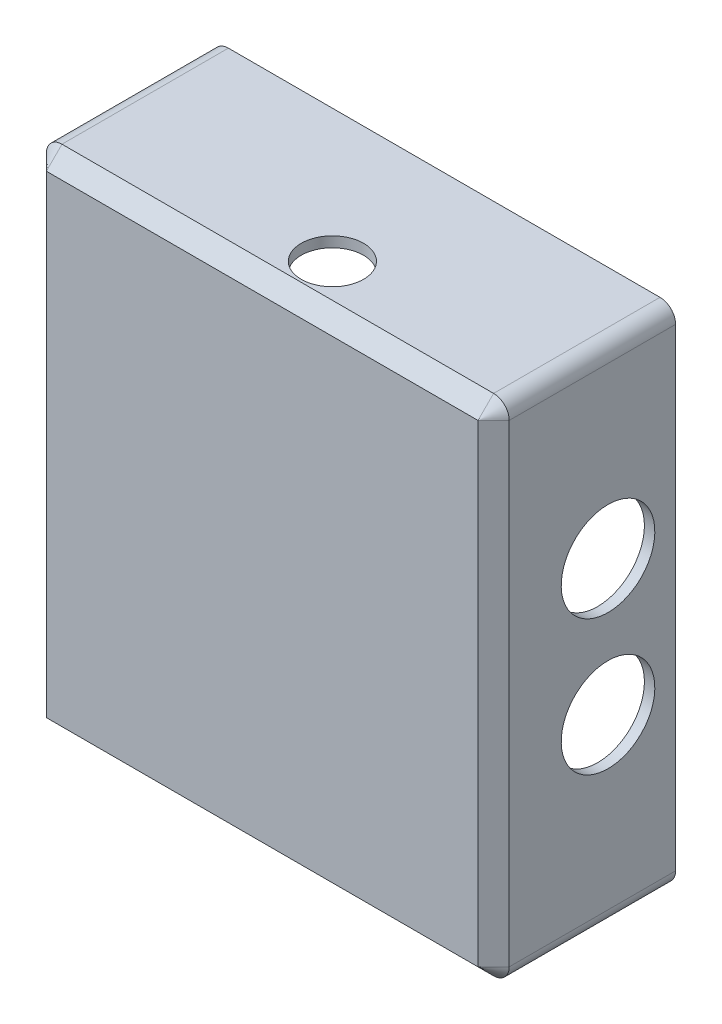
ISO-10303-21;
HEADER;
FILE_DESCRIPTION(('STEP AP214'),'2;1');
FILE_NAME('part.step','',(''),(''),'','','');
FILE_SCHEMA(('AUTOMOTIVE_DESIGN { 1 0 10303 214 1 1 1 1 }'));
ENDSEC;
DATA;
#1=APPLICATION_CONTEXT('core data for automotive mechanical design processes');
#2=APPLICATION_PROTOCOL_DEFINITION('international standard','automotive_design',2000,#1);
#3=PRODUCT_CONTEXT('',#1,'mechanical');
#4=PRODUCT('Part','Part','',(#3));
#5=PRODUCT_RELATED_PRODUCT_CATEGORY('part','',(#4));
#6=PRODUCT_DEFINITION_FORMATION('','',#4);
#7=PRODUCT_DEFINITION_CONTEXT('part definition',#1,'design');
#8=PRODUCT_DEFINITION('design','',#6,#7);
#9=PRODUCT_DEFINITION_SHAPE('','',#8);
#10=(LENGTH_UNIT() NAMED_UNIT(*) SI_UNIT(.MILLI.,.METRE.));
#11=(NAMED_UNIT(*) PLANE_ANGLE_UNIT() SI_UNIT($,.RADIAN.));
#12=(NAMED_UNIT(*) SI_UNIT($,.STERADIAN.) SOLID_ANGLE_UNIT());
#13=UNCERTAINTY_MEASURE_WITH_UNIT(LENGTH_MEASURE(1.E-05),#10,'distance_accuracy_value','');
#14=(GEOMETRIC_REPRESENTATION_CONTEXT(3) GLOBAL_UNCERTAINTY_ASSIGNED_CONTEXT((#13)) GLOBAL_UNIT_ASSIGNED_CONTEXT((#10,
#11,#12)) REPRESENTATION_CONTEXT('',''));
#15=CARTESIAN_POINT('',(0.,0.,0.));
#16=DIRECTION('',(0.,0.,1.));
#17=DIRECTION('',(1.,0.,0.));
#18=AXIS2_PLACEMENT_3D('',#15,#16,#17);
#19=CARTESIAN_POINT('',(0.,0.,0.));
#20=DIRECTION('',(0.,0.,1.));
#21=DIRECTION('',(1.,0.,0.));
#22=AXIS2_PLACEMENT_3D('',#19,#20,#21);
#23=PLANE('',#22);
#24=DIRECTION('',(-1.,0.,0.));
#25=VECTOR('',#24,1.);
#26=CARTESIAN_POINT('',(-44.5,48.5,0.));
#27=LINE('',#26,#25);
#28=CARTESIAN_POINT('',(41.5,48.5,0.));
#29=VERTEX_POINT('',#28);
#30=CARTESIAN_POINT('',(-41.5,48.5,0.));
#31=VERTEX_POINT('',#30);
#32=EDGE_CURVE('E306',#29,#31,#27,.T.);
#33=ORIENTED_EDGE('',*,*,#32,.F.);
#34=CARTESIAN_POINT('',(41.5,45.5,0.));
#35=DIRECTION('',(0.,0.,1.));
#36=DIRECTION('',(1.,0.,0.));
#37=AXIS2_PLACEMENT_3D('',#34,#35,#36);
#38=CIRCLE('',#37,3.);
#39=CARTESIAN_POINT('',(44.5,45.5,0.));
#40=VERTEX_POINT('',#39);
#41=EDGE_CURVE('E327',#29,#40,#38,.F.);
#42=ORIENTED_EDGE('',*,*,#41,.T.);
#43=DIRECTION('',(0.,1.,0.));
#44=VECTOR('',#43,1.);
#45=CARTESIAN_POINT('',(44.5,48.5,0.));
#46=LINE('',#45,#44);
#47=CARTESIAN_POINT('',(44.5,-45.5,0.));
#48=VERTEX_POINT('',#47);
#49=EDGE_CURVE('E303',#48,#40,#46,.T.);
#50=ORIENTED_EDGE('',*,*,#49,.F.);
#51=CARTESIAN_POINT('',(41.5,-45.5,0.));
#52=DIRECTION('',(0.,0.,1.));
#53=DIRECTION('',(1.,0.,0.));
#54=AXIS2_PLACEMENT_3D('',#51,#52,#53);
#55=CIRCLE('',#54,3.);
#56=CARTESIAN_POINT('',(41.5,-48.5,0.));
#57=VERTEX_POINT('',#56);
#58=EDGE_CURVE('E325',#48,#57,#55,.F.);
#59=ORIENTED_EDGE('',*,*,#58,.T.);
#60=DIRECTION('',(1.,0.,0.));
#61=VECTOR('',#60,1.);
#62=CARTESIAN_POINT('',(-44.5,-48.5,0.));
#63=LINE('',#62,#61);
#64=CARTESIAN_POINT('',(-41.5,-48.5,0.));
#65=VERTEX_POINT('',#64);
#66=EDGE_CURVE('E313',#65,#57,#63,.T.);
#67=ORIENTED_EDGE('',*,*,#66,.F.);
#68=CARTESIAN_POINT('',(-41.5,-45.5,0.));
#69=DIRECTION('',(0.,0.,1.));
#70=DIRECTION('',(1.,0.,0.));
#71=AXIS2_PLACEMENT_3D('',#68,#69,#70);
#72=CIRCLE('',#71,3.);
#73=CARTESIAN_POINT('',(-44.5,-45.5,0.));
#74=VERTEX_POINT('',#73);
#75=EDGE_CURVE('E323',#65,#74,#72,.F.);
#76=ORIENTED_EDGE('',*,*,#75,.T.);
#77=DIRECTION('',(0.,-1.,0.));
#78=VECTOR('',#77,1.);
#79=CARTESIAN_POINT('',(-44.5,48.5,0.));
#80=LINE('',#79,#78);
#81=CARTESIAN_POINT('',(-44.5,45.5,0.));
#82=VERTEX_POINT('',#81);
#83=EDGE_CURVE('E310',#82,#74,#80,.T.);
#84=ORIENTED_EDGE('',*,*,#83,.F.);
#85=CARTESIAN_POINT('',(-41.5,45.5,0.));
#86=DIRECTION('',(0.,0.,1.));
#87=DIRECTION('',(1.,0.,0.));
#88=AXIS2_PLACEMENT_3D('',#85,#86,#87);
#89=CIRCLE('',#88,3.);
#90=EDGE_CURVE('E321',#82,#31,#89,.F.);
#91=ORIENTED_EDGE('',*,*,#90,.T.);
#92=EDGE_LOOP('',(#33,#42,#50,#59,#67,#76,#84,#91));
#93=FACE_BOUND('',#92,.T.);
#94=CARTESIAN_POINT('',(41.5,45.5,0.));
#95=DIRECTION('',(0.,0.,1.));
#96=DIRECTION('',(1.,0.,0.));
#97=AXIS2_PLACEMENT_3D('',#94,#95,#96);
#98=CIRCLE('',#97,1.);
#99=CARTESIAN_POINT('',(41.5,46.5,0.));
#100=VERTEX_POINT('',#99);
#101=CARTESIAN_POINT('',(42.5,45.5,0.));
#102=VERTEX_POINT('',#101);
#103=EDGE_CURVE('E289',#100,#102,#98,.F.);
#104=ORIENTED_EDGE('',*,*,#103,.F.);
#105=DIRECTION('',(-1.,0.,0.));
#106=VECTOR('',#105,1.);
#107=CARTESIAN_POINT('',(-44.5,46.5,0.));
#108=LINE('',#107,#106);
#109=CARTESIAN_POINT('',(-41.5,46.5,0.));
#110=VERTEX_POINT('',#109);
#111=EDGE_CURVE('E286',#100,#110,#108,.T.);
#112=ORIENTED_EDGE('',*,*,#111,.T.);
#113=CARTESIAN_POINT('',(-41.5,45.5,0.));
#114=DIRECTION('',(0.,0.,1.));
#115=DIRECTION('',(1.,0.,0.));
#116=AXIS2_PLACEMENT_3D('',#113,#114,#115);
#117=CIRCLE('',#116,1.);
#118=CARTESIAN_POINT('',(-42.5,45.5,0.));
#119=VERTEX_POINT('',#118);
#120=EDGE_CURVE('E295',#119,#110,#117,.F.);
#121=ORIENTED_EDGE('',*,*,#120,.F.);
#122=DIRECTION('',(0.,-1.,0.));
#123=VECTOR('',#122,1.);
#124=CARTESIAN_POINT('',(-42.5,48.5,0.));
#125=LINE('',#124,#123);
#126=CARTESIAN_POINT('',(-42.5,-45.5,0.));
#127=VERTEX_POINT('',#126);
#128=EDGE_CURVE('E58',#119,#127,#125,.T.);
#129=ORIENTED_EDGE('',*,*,#128,.T.);
#130=CARTESIAN_POINT('',(-41.5,-45.5,0.));
#131=DIRECTION('',(0.,0.,1.));
#132=DIRECTION('',(1.,0.,0.));
#133=AXIS2_PLACEMENT_3D('',#130,#131,#132);
#134=CIRCLE('',#133,1.);
#135=CARTESIAN_POINT('',(-41.5,-46.5,0.));
#136=VERTEX_POINT('',#135);
#137=EDGE_CURVE('E290',#136,#127,#134,.F.);
#138=ORIENTED_EDGE('',*,*,#137,.F.);
#139=DIRECTION('',(1.,0.,0.));
#140=VECTOR('',#139,1.);
#141=CARTESIAN_POINT('',(-44.5,-46.5,0.));
#142=LINE('',#141,#140);
#143=CARTESIAN_POINT('',(41.5,-46.5,0.));
#144=VERTEX_POINT('',#143);
#145=EDGE_CURVE('E291',#136,#144,#142,.T.);
#146=ORIENTED_EDGE('',*,*,#145,.T.);
#147=CARTESIAN_POINT('',(41.5,-45.5,0.));
#148=DIRECTION('',(0.,0.,1.));
#149=DIRECTION('',(1.,0.,0.));
#150=AXIS2_PLACEMENT_3D('',#147,#148,#149);
#151=CIRCLE('',#150,1.);
#152=CARTESIAN_POINT('',(42.5,-45.5,0.));
#153=VERTEX_POINT('',#152);
#154=EDGE_CURVE('E287',#153,#144,#151,.F.);
#155=ORIENTED_EDGE('',*,*,#154,.F.);
#156=DIRECTION('',(0.,1.,0.));
#157=VECTOR('',#156,1.);
#158=CARTESIAN_POINT('',(42.5,48.5,0.));
#159=LINE('',#158,#157);
#160=EDGE_CURVE('E262',#153,#102,#159,.T.);
#161=ORIENTED_EDGE('',*,*,#160,.T.);
#162=EDGE_LOOP('',(#104,#112,#121,#129,#138,#146,#155,#161));
#163=FACE_BOUND('',#162,.T.);
#164=ADVANCED_FACE('F34',(#93,#163),#23,.F.);
#165=CARTESIAN_POINT('',(44.5,48.5,35.));
#166=DIRECTION('',(-1.,0.,0.));
#167=DIRECTION('',(0.,-1.,0.));
#168=AXIS2_PLACEMENT_3D('',#165,#166,#167);
#169=PLANE('',#168);
#170=CARTESIAN_POINT('',(44.5,13.,13.));
#171=DIRECTION('',(1.,0.,0.));
#172=DIRECTION('',(0.,1.,0.));
#173=AXIS2_PLACEMENT_3D('',#170,#171,#172);
#174=CIRCLE('',#173,9.);
#175=CARTESIAN_POINT('',(44.5,22.,13.));
#176=VERTEX_POINT('',#175);
#177=EDGE_CURVE('E393',#176,#176,#174,.T.);
#178=ORIENTED_EDGE('',*,*,#177,.F.);
#179=EDGE_LOOP('',(#178));
#180=FACE_BOUND('',#179,.T.);
#181=CARTESIAN_POINT('',(44.5,-13.,13.));
#182=DIRECTION('',(1.,0.,0.));
#183=DIRECTION('',(0.,1.,0.));
#184=AXIS2_PLACEMENT_3D('',#181,#182,#183);
#185=CIRCLE('',#184,9.);
#186=CARTESIAN_POINT('',(44.5,-4.,13.));
#187=VERTEX_POINT('',#186);
#188=EDGE_CURVE('E421',#187,#187,#185,.T.);
#189=ORIENTED_EDGE('',*,*,#188,.F.);
#190=EDGE_LOOP('',(#189));
#191=FACE_BOUND('',#190,.T.);
#192=DIRECTION('',(0.,0.,-1.));
#193=VECTOR('',#192,1.);
#194=CARTESIAN_POINT('',(44.5,45.5,35.));
#195=LINE('',#194,#193);
#196=CARTESIAN_POINT('',(44.5,45.5,32.));
#197=VERTEX_POINT('',#196);
#198=EDGE_CURVE('E331',#40,#197,#195,.F.);
#199=ORIENTED_EDGE('',*,*,#198,.T.);
#200=DIRECTION('',(0.,-1.,0.));
#201=VECTOR('',#200,1.);
#202=CARTESIAN_POINT('',(44.5,-45.5,32.));
#203=LINE('',#202,#201);
#204=CARTESIAN_POINT('',(44.5,-45.5,32.));
#205=VERTEX_POINT('',#204);
#206=EDGE_CURVE('E44',#197,#205,#203,.T.);
#207=ORIENTED_EDGE('',*,*,#206,.T.);
#208=DIRECTION('',(0.,0.,-1.));
#209=VECTOR('',#208,1.);
#210=CARTESIAN_POINT('',(44.5,-45.5,35.));
#211=LINE('',#210,#209);
#212=EDGE_CURVE('E329',#205,#48,#211,.T.);
#213=ORIENTED_EDGE('',*,*,#212,.T.);
#214=ORIENTED_EDGE('',*,*,#49,.T.);
#215=EDGE_LOOP('',(#199,#207,#213,#214));
#216=FACE_BOUND('',#215,.T.);
#217=ADVANCED_FACE('F476',(#180,#191,#216),#169,.F.);
#218=CARTESIAN_POINT('',(-44.5,48.5,35.));
#219=DIRECTION('',(0.,-1.,0.));
#220=DIRECTION('',(0.,0.,-1.));
#221=AXIS2_PLACEMENT_3D('',#218,#219,#220);
#222=PLANE('',#221);
#223=CARTESIAN_POINT('',(3.99999999999999,48.5,25.5));
#224=DIRECTION('',(0.,1.,0.));
#225=DIRECTION('',(0.,0.,1.));
#226=AXIS2_PLACEMENT_3D('',#223,#224,#225);
#227=CIRCLE('',#226,6.);
#228=CARTESIAN_POINT('',(3.99999999999999,48.5,31.5));
#229=VERTEX_POINT('',#228);
#230=EDGE_CURVE('E203',#229,#229,#227,.T.);
#231=ORIENTED_EDGE('',*,*,#230,.F.);
#232=EDGE_LOOP('',(#231));
#233=FACE_BOUND('',#232,.T.);
#234=DIRECTION('',(0.,0.,-1.));
#235=VECTOR('',#234,1.);
#236=CARTESIAN_POINT('',(-41.5,48.5,35.));
#237=LINE('',#236,#235);
#238=CARTESIAN_POINT('',(-41.5,48.5,32.));
#239=VERTEX_POINT('',#238);
#240=EDGE_CURVE('E316',#31,#239,#237,.F.);
#241=ORIENTED_EDGE('',*,*,#240,.T.);
#242=DIRECTION('',(1.,0.,0.));
#243=VECTOR('',#242,1.);
#244=CARTESIAN_POINT('',(41.5,48.5,32.));
#245=LINE('',#244,#243);
#246=CARTESIAN_POINT('',(41.5,48.5,32.));
#247=VERTEX_POINT('',#246);
#248=EDGE_CURVE('E364',#239,#247,#245,.T.);
#249=ORIENTED_EDGE('',*,*,#248,.T.);
#250=DIRECTION('',(0.,0.,-1.));
#251=VECTOR('',#250,1.);
#252=CARTESIAN_POINT('',(41.5,48.5,35.));
#253=LINE('',#252,#251);
#254=EDGE_CURVE('E319',#247,#29,#253,.T.);
#255=ORIENTED_EDGE('',*,*,#254,.T.);
#256=ORIENTED_EDGE('',*,*,#32,.T.);
#257=EDGE_LOOP('',(#241,#249,#255,#256));
#258=FACE_BOUND('',#257,.T.);
#259=ADVANCED_FACE('F482',(#233,#258),#222,.F.);
#260=CARTESIAN_POINT('',(-44.5,48.5,35.));
#261=DIRECTION('',(1.,0.,0.));
#262=DIRECTION('',(0.,1.,0.));
#263=AXIS2_PLACEMENT_3D('',#260,#261,#262);
#264=PLANE('',#263);
#265=CARTESIAN_POINT('',(-44.5,13.,13.));
#266=DIRECTION('',(1.,0.,0.));
#267=DIRECTION('',(0.,1.,0.));
#268=AXIS2_PLACEMENT_3D('',#265,#266,#267);
#269=CIRCLE('',#268,9.);
#270=CARTESIAN_POINT('',(-44.5,22.,13.));
#271=VERTEX_POINT('',#270);
#272=EDGE_CURVE('E418',#271,#271,#269,.T.);
#273=ORIENTED_EDGE('',*,*,#272,.T.);
#274=EDGE_LOOP('',(#273));
#275=FACE_BOUND('',#274,.T.);
#276=CARTESIAN_POINT('',(-44.5,-13.,13.));
#277=DIRECTION('',(1.,0.,0.));
#278=DIRECTION('',(0.,1.,0.));
#279=AXIS2_PLACEMENT_3D('',#276,#277,#278);
#280=CIRCLE('',#279,9.);
#281=CARTESIAN_POINT('',(-44.5,-4.00000000000001,13.));
#282=VERTEX_POINT('',#281);
#283=EDGE_CURVE('E413',#282,#282,#280,.T.);
#284=ORIENTED_EDGE('',*,*,#283,.T.);
#285=EDGE_LOOP('',(#284));
#286=FACE_BOUND('',#285,.T.);
#287=DIRECTION('',(0.,0.,-1.));
#288=VECTOR('',#287,1.);
#289=CARTESIAN_POINT('',(-44.5,-45.5,35.));
#290=LINE('',#289,#288);
#291=CARTESIAN_POINT('',(-44.5,-45.5,32.));
#292=VERTEX_POINT('',#291);
#293=EDGE_CURVE('E341',#74,#292,#290,.F.);
#294=ORIENTED_EDGE('',*,*,#293,.T.);
#295=DIRECTION('',(0.,1.,0.));
#296=VECTOR('',#295,1.);
#297=CARTESIAN_POINT('',(-44.5,45.5,32.));
#298=LINE('',#297,#296);
#299=CARTESIAN_POINT('',(-44.5,45.5,32.));
#300=VERTEX_POINT('',#299);
#301=EDGE_CURVE('E360',#292,#300,#298,.T.);
#302=ORIENTED_EDGE('',*,*,#301,.T.);
#303=DIRECTION('',(0.,0.,-1.));
#304=VECTOR('',#303,1.);
#305=CARTESIAN_POINT('',(-44.5,45.5,35.));
#306=LINE('',#305,#304);
#307=EDGE_CURVE('E339',#300,#82,#306,.T.);
#308=ORIENTED_EDGE('',*,*,#307,.T.);
#309=ORIENTED_EDGE('',*,*,#83,.T.);
#310=EDGE_LOOP('',(#294,#302,#308,#309));
#311=FACE_BOUND('',#310,.T.);
#312=ADVANCED_FACE('F493',(#275,#286,#311),#264,.F.);
#313=CARTESIAN_POINT('',(-44.5,-48.5,35.));
#314=DIRECTION('',(0.,1.,0.));
#315=DIRECTION('',(0.,0.,1.));
#316=AXIS2_PLACEMENT_3D('',#313,#314,#315);
#317=PLANE('',#316);
#318=CARTESIAN_POINT('',(-13.,-48.5,13.));
#319=DIRECTION('',(0.,-1.,0.));
#320=DIRECTION('',(0.,0.,-1.));
#321=AXIS2_PLACEMENT_3D('',#318,#319,#320);
#322=CIRCLE('',#321,9.);
#323=CARTESIAN_POINT('',(-13.,-48.5,4.));
#324=VERTEX_POINT('',#323);
#325=EDGE_CURVE('E397',#324,#324,#322,.T.);
#326=ORIENTED_EDGE('',*,*,#325,.F.);
#327=EDGE_LOOP('',(#326));
#328=FACE_BOUND('',#327,.T.);
#329=CARTESIAN_POINT('',(13.,-48.5,13.));
#330=DIRECTION('',(0.,-1.,0.));
#331=DIRECTION('',(0.,0.,-1.));
#332=AXIS2_PLACEMENT_3D('',#329,#330,#331);
#333=CIRCLE('',#332,9.00000000000001);
#334=CARTESIAN_POINT('',(13.,-48.5,3.99999999999999));
#335=VERTEX_POINT('',#334);
#336=EDGE_CURVE('E403',#335,#335,#333,.T.);
#337=ORIENTED_EDGE('',*,*,#336,.F.);
#338=EDGE_LOOP('',(#337));
#339=FACE_BOUND('',#338,.T.);
#340=DIRECTION('',(0.,0.,-1.));
#341=VECTOR('',#340,1.);
#342=CARTESIAN_POINT('',(41.5,-48.5,35.));
#343=LINE('',#342,#341);
#344=CARTESIAN_POINT('',(41.5,-48.5,32.));
#345=VERTEX_POINT('',#344);
#346=EDGE_CURVE('E336',#57,#345,#343,.F.);
#347=ORIENTED_EDGE('',*,*,#346,.T.);
#348=DIRECTION('',(-1.,0.,0.));
#349=VECTOR('',#348,1.);
#350=CARTESIAN_POINT('',(-41.5,-48.5,32.));
#351=LINE('',#350,#349);
#352=CARTESIAN_POINT('',(-41.5,-48.5,32.));
#353=VERTEX_POINT('',#352);
#354=EDGE_CURVE('E356',#345,#353,#351,.T.);
#355=ORIENTED_EDGE('',*,*,#354,.T.);
#356=DIRECTION('',(0.,0.,-1.));
#357=VECTOR('',#356,1.);
#358=CARTESIAN_POINT('',(-41.5,-48.5,35.));
#359=LINE('',#358,#357);
#360=EDGE_CURVE('E334',#353,#65,#359,.T.);
#361=ORIENTED_EDGE('',*,*,#360,.T.);
#362=ORIENTED_EDGE('',*,*,#66,.T.);
#363=EDGE_LOOP('',(#347,#355,#361,#362));
#364=FACE_BOUND('',#363,.T.);
#365=ADVANCED_FACE('F490',(#328,#339,#364),#317,.F.);
#366=CARTESIAN_POINT('',(0.,0.,35.));
#367=DIRECTION('',(0.,0.,1.));
#368=DIRECTION('',(1.,0.,0.));
#369=AXIS2_PLACEMENT_3D('',#366,#367,#368);
#370=PLANE('',#369);
#371=DIRECTION('',(0.,-1.,0.));
#372=VECTOR('',#371,1.);
#373=CARTESIAN_POINT('',(-41.5,-45.5,35.));
#374=LINE('',#373,#372);
#375=CARTESIAN_POINT('',(-41.5,45.5,35.));
#376=VERTEX_POINT('',#375);
#377=CARTESIAN_POINT('',(-41.5,-45.5,35.));
#378=VERTEX_POINT('',#377);
#379=EDGE_CURVE('E351',#376,#378,#374,.T.);
#380=ORIENTED_EDGE('',*,*,#379,.T.);
#381=DIRECTION('',(1.,0.,0.));
#382=VECTOR('',#381,1.);
#383=CARTESIAN_POINT('',(41.5,-45.5,35.));
#384=LINE('',#383,#382);
#385=CARTESIAN_POINT('',(41.5,-45.5,35.));
#386=VERTEX_POINT('',#385);
#387=EDGE_CURVE('E353',#378,#386,#384,.T.);
#388=ORIENTED_EDGE('',*,*,#387,.T.);
#389=DIRECTION('',(0.,1.,0.));
#390=VECTOR('',#389,1.);
#391=CARTESIAN_POINT('',(41.5,45.5,35.));
#392=LINE('',#391,#390);
#393=CARTESIAN_POINT('',(41.5,45.5,35.));
#394=VERTEX_POINT('',#393);
#395=EDGE_CURVE('E347',#386,#394,#392,.T.);
#396=ORIENTED_EDGE('',*,*,#395,.T.);
#397=DIRECTION('',(-1.,0.,0.));
#398=VECTOR('',#397,1.);
#399=CARTESIAN_POINT('',(-41.5,45.5,35.));
#400=LINE('',#399,#398);
#401=EDGE_CURVE('E349',#394,#376,#400,.T.);
#402=ORIENTED_EDGE('',*,*,#401,.T.);
#403=EDGE_LOOP('',(#380,#388,#396,#402));
#404=FACE_BOUND('',#403,.T.);
#405=ADVANCED_FACE('F488',(#404),#370,.T.);
#406=CARTESIAN_POINT('',(41.5,45.5,35.));
#407=DIRECTION('',(0.,0.,-1.));
#408=DIRECTION('',(-1.,0.,0.));
#409=AXIS2_PLACEMENT_3D('',#406,#407,#408);
#410=CYLINDRICAL_SURFACE('',#409,3.);
#411=ORIENTED_EDGE('',*,*,#254,.F.);
#412=CARTESIAN_POINT('',(41.5,45.5,32.));
#413=DIRECTION('',(0.,0.,1.));
#414=DIRECTION('',(1.,0.,0.));
#415=AXIS2_PLACEMENT_3D('',#412,#413,#414);
#416=CIRCLE('',#415,3.);
#417=EDGE_CURVE('E366',#247,#197,#416,.F.);
#418=ORIENTED_EDGE('',*,*,#417,.T.);
#419=ORIENTED_EDGE('',*,*,#198,.F.);
#420=ORIENTED_EDGE('',*,*,#41,.F.);
#421=EDGE_LOOP('',(#411,#418,#419,#420));
#422=FACE_BOUND('',#421,.T.);
#423=ADVANCED_FACE('F501',(#422),#410,.T.);
#424=CARTESIAN_POINT('',(41.5,-45.5,35.));
#425=DIRECTION('',(0.,0.,-1.));
#426=DIRECTION('',(-1.,0.,0.));
#427=AXIS2_PLACEMENT_3D('',#424,#425,#426);
#428=CYLINDRICAL_SURFACE('',#427,3.);
#429=ORIENTED_EDGE('',*,*,#212,.F.);
#430=CARTESIAN_POINT('',(41.5,-45.5,32.));
#431=DIRECTION('',(0.,0.,1.));
#432=DIRECTION('',(1.,0.,0.));
#433=AXIS2_PLACEMENT_3D('',#430,#431,#432);
#434=CIRCLE('',#433,3.);
#435=EDGE_CURVE('E344',#205,#345,#434,.F.);
#436=ORIENTED_EDGE('',*,*,#435,.T.);
#437=ORIENTED_EDGE('',*,*,#346,.F.);
#438=ORIENTED_EDGE('',*,*,#58,.F.);
#439=EDGE_LOOP('',(#429,#436,#437,#438));
#440=FACE_BOUND('',#439,.T.);
#441=ADVANCED_FACE('F504',(#440),#428,.T.);
#442=CARTESIAN_POINT('',(-41.5,-45.5,35.));
#443=DIRECTION('',(0.,0.,-1.));
#444=DIRECTION('',(-1.,0.,0.));
#445=AXIS2_PLACEMENT_3D('',#442,#443,#444);
#446=CYLINDRICAL_SURFACE('',#445,3.);
#447=ORIENTED_EDGE('',*,*,#360,.F.);
#448=CARTESIAN_POINT('',(-41.5,-45.5,32.));
#449=DIRECTION('',(0.,0.,1.));
#450=DIRECTION('',(1.,0.,0.));
#451=AXIS2_PLACEMENT_3D('',#448,#449,#450);
#452=CIRCLE('',#451,3.);
#453=EDGE_CURVE('E358',#353,#292,#452,.F.);
#454=ORIENTED_EDGE('',*,*,#453,.T.);
#455=ORIENTED_EDGE('',*,*,#293,.F.);
#456=ORIENTED_EDGE('',*,*,#75,.F.);
#457=EDGE_LOOP('',(#447,#454,#455,#456));
#458=FACE_BOUND('',#457,.T.);
#459=ADVANCED_FACE('F508',(#458),#446,.T.);
#460=CARTESIAN_POINT('',(-41.5,45.5,35.));
#461=DIRECTION('',(0.,0.,-1.));
#462=DIRECTION('',(-1.,0.,0.));
#463=AXIS2_PLACEMENT_3D('',#460,#461,#462);
#464=CYLINDRICAL_SURFACE('',#463,3.);
#465=ORIENTED_EDGE('',*,*,#307,.F.);
#466=CARTESIAN_POINT('',(-41.5,45.5,32.));
#467=DIRECTION('',(0.,0.,1.));
#468=DIRECTION('',(1.,0.,0.));
#469=AXIS2_PLACEMENT_3D('',#466,#467,#468);
#470=CIRCLE('',#469,3.);
#471=EDGE_CURVE('E362',#300,#239,#470,.F.);
#472=ORIENTED_EDGE('',*,*,#471,.T.);
#473=ORIENTED_EDGE('',*,*,#240,.F.);
#474=ORIENTED_EDGE('',*,*,#90,.F.);
#475=EDGE_LOOP('',(#465,#472,#473,#474));
#476=FACE_BOUND('',#475,.T.);
#477=ADVANCED_FACE('F512',(#476),#464,.T.);
#478=CARTESIAN_POINT('',(-41.5,45.5,32.));
#479=DIRECTION('',(0.,0.,-1.));
#480=DIRECTION('',(-1.,0.,0.));
#481=AXIS2_PLACEMENT_3D('',#478,#479,#480);
#482=CONICAL_SURFACE('',#481,2.99999999999996,0.785398163397446);
#483=DIRECTION('',(0.,-0.707106781186546,0.707106781186549));
#484=VECTOR('',#483,1.);
#485=CARTESIAN_POINT('',(-41.5,48.5,32.));
#486=LINE('',#485,#484);
#487=EDGE_CURVE('E384',#239,#376,#486,.T.);
#488=ORIENTED_EDGE('',*,*,#487,.F.);
#489=ORIENTED_EDGE('',*,*,#471,.F.);
#490=DIRECTION('',(-0.707106781186546,0.,-0.707106781186549));
#491=VECTOR('',#490,1.);
#492=CARTESIAN_POINT('',(-41.5,45.5,35.));
#493=LINE('',#492,#491);
#494=EDGE_CURVE('E307',#376,#300,#493,.T.);
#495=ORIENTED_EDGE('',*,*,#494,.F.);
#496=EDGE_LOOP('',(#488,#489,#495));
#497=FACE_BOUND('',#496,.T.);
#498=ADVANCED_FACE('F37',(#497),#482,.T.);
#499=CARTESIAN_POINT('',(-41.5,0.,35.));
#500=DIRECTION('',(-0.707106781186549,0.,0.707106781186546));
#501=DIRECTION('',(0.,1.,0.));
#502=AXIS2_PLACEMENT_3D('',#499,#500,#501);
#503=PLANE('',#502);
#504=ORIENTED_EDGE('',*,*,#494,.T.);
#505=ORIENTED_EDGE('',*,*,#301,.F.);
#506=DIRECTION('',(-0.707106781186546,0.,-0.707106781186549));
#507=VECTOR('',#506,1.);
#508=CARTESIAN_POINT('',(-41.5,-45.5,35.));
#509=LINE('',#508,#507);
#510=EDGE_CURVE('E381',#378,#292,#509,.T.);
#511=ORIENTED_EDGE('',*,*,#510,.F.);
#512=ORIENTED_EDGE('',*,*,#379,.F.);
#513=EDGE_LOOP('',(#504,#505,#511,#512));
#514=FACE_BOUND('',#513,.T.);
#515=ADVANCED_FACE('F558',(#514),#503,.T.);
#516=CARTESIAN_POINT('',(0.,45.5,35.));
#517=DIRECTION('',(0.,0.707106781186549,0.707106781186546));
#518=DIRECTION('',(1.,0.,0.));
#519=AXIS2_PLACEMENT_3D('',#516,#517,#518);
#520=PLANE('',#519);
#521=ORIENTED_EDGE('',*,*,#487,.T.);
#522=ORIENTED_EDGE('',*,*,#401,.F.);
#523=DIRECTION('',(0.,-0.707106781186546,0.707106781186549));
#524=VECTOR('',#523,1.);
#525=CARTESIAN_POINT('',(41.5,48.5,32.));
#526=LINE('',#525,#524);
#527=EDGE_CURVE('E378',#247,#394,#526,.T.);
#528=ORIENTED_EDGE('',*,*,#527,.F.);
#529=ORIENTED_EDGE('',*,*,#248,.F.);
#530=EDGE_LOOP('',(#521,#522,#528,#529));
#531=FACE_BOUND('',#530,.T.);
#532=ADVANCED_FACE('F552',(#531),#520,.T.);
#533=CARTESIAN_POINT('',(-41.5,-45.5,32.));
#534=DIRECTION('',(0.,0.,-1.));
#535=DIRECTION('',(-1.,0.,0.));
#536=AXIS2_PLACEMENT_3D('',#533,#534,#535);
#537=CONICAL_SURFACE('',#536,2.99999999999996,0.785398163397446);
#538=ORIENTED_EDGE('',*,*,#510,.T.);
#539=ORIENTED_EDGE('',*,*,#453,.F.);
#540=DIRECTION('',(0.,-0.707106781186546,-0.707106781186549));
#541=VECTOR('',#540,1.);
#542=CARTESIAN_POINT('',(-41.5,-45.5,35.));
#543=LINE('',#542,#541);
#544=EDGE_CURVE('E375',#378,#353,#543,.T.);
#545=ORIENTED_EDGE('',*,*,#544,.F.);
#546=EDGE_LOOP('',(#538,#539,#545));
#547=FACE_BOUND('',#546,.T.);
#548=ADVANCED_FACE('F545',(#547),#537,.T.);
#549=CARTESIAN_POINT('',(41.5,45.5,32.));
#550=DIRECTION('',(0.,0.,-1.));
#551=DIRECTION('',(-1.,0.,0.));
#552=AXIS2_PLACEMENT_3D('',#549,#550,#551);
#553=CONICAL_SURFACE('',#552,2.99999999999996,0.785398163397446);
#554=ORIENTED_EDGE('',*,*,#417,.F.);
#555=ORIENTED_EDGE('',*,*,#527,.T.);
#556=DIRECTION('',(-0.707106781186546,0.,0.707106781186549));
#557=VECTOR('',#556,1.);
#558=CARTESIAN_POINT('',(44.5,45.5,32.));
#559=LINE('',#558,#557);
#560=EDGE_CURVE('E372',#197,#394,#559,.T.);
#561=ORIENTED_EDGE('',*,*,#560,.F.);
#562=EDGE_LOOP('',(#554,#555,#561));
#563=FACE_BOUND('',#562,.T.);
#564=ADVANCED_FACE('F538',(#563),#553,.T.);
#565=CARTESIAN_POINT('',(0.,-45.5,35.));
#566=DIRECTION('',(0.,-0.707106781186549,0.707106781186546));
#567=DIRECTION('',(-1.,0.,0.));
#568=AXIS2_PLACEMENT_3D('',#565,#566,#567);
#569=PLANE('',#568);
#570=ORIENTED_EDGE('',*,*,#544,.T.);
#571=ORIENTED_EDGE('',*,*,#354,.F.);
#572=DIRECTION('',(0.,-0.707106781186546,-0.707106781186549));
#573=VECTOR('',#572,1.);
#574=CARTESIAN_POINT('',(41.5,-45.5,35.));
#575=LINE('',#574,#573);
#576=EDGE_CURVE('E370',#386,#345,#575,.T.);
#577=ORIENTED_EDGE('',*,*,#576,.F.);
#578=ORIENTED_EDGE('',*,*,#387,.F.);
#579=EDGE_LOOP('',(#570,#571,#577,#578));
#580=FACE_BOUND('',#579,.T.);
#581=ADVANCED_FACE('F531',(#580),#569,.T.);
#582=CARTESIAN_POINT('',(41.5,0.,35.));
#583=DIRECTION('',(0.707106781186549,0.,0.707106781186546));
#584=DIRECTION('',(0.,-1.,0.));
#585=AXIS2_PLACEMENT_3D('',#582,#583,#584);
#586=PLANE('',#585);
#587=ORIENTED_EDGE('',*,*,#560,.T.);
#588=ORIENTED_EDGE('',*,*,#395,.F.);
#589=DIRECTION('',(-0.707106781186546,0.,0.707106781186549));
#590=VECTOR('',#589,1.);
#591=CARTESIAN_POINT('',(44.5,-45.5,32.));
#592=LINE('',#591,#590);
#593=EDGE_CURVE('E283',#205,#386,#592,.T.);
#594=ORIENTED_EDGE('',*,*,#593,.F.);
#595=ORIENTED_EDGE('',*,*,#206,.F.);
#596=EDGE_LOOP('',(#587,#588,#594,#595));
#597=FACE_BOUND('',#596,.T.);
#598=ADVANCED_FACE('F524',(#597),#586,.T.);
#599=CARTESIAN_POINT('',(41.5,-45.5,32.));
#600=DIRECTION('',(0.,0.,-1.));
#601=DIRECTION('',(-1.,0.,0.));
#602=AXIS2_PLACEMENT_3D('',#599,#600,#601);
#603=CONICAL_SURFACE('',#602,2.99999999999996,0.785398163397446);
#604=ORIENTED_EDGE('',*,*,#576,.T.);
#605=ORIENTED_EDGE('',*,*,#435,.F.);
#606=ORIENTED_EDGE('',*,*,#593,.T.);
#607=EDGE_LOOP('',(#604,#605,#606));
#608=FACE_BOUND('',#607,.T.);
#609=ADVANCED_FACE('F518',(#608),#603,.T.);
#610=CARTESIAN_POINT('',(42.5,48.5,35.));
#611=DIRECTION('',(-1.,0.,0.));
#612=DIRECTION('',(0.,-1.,0.));
#613=AXIS2_PLACEMENT_3D('',#610,#611,#612);
#614=PLANE('',#613);
#615=CARTESIAN_POINT('',(42.5,13.,13.));
#616=DIRECTION('',(-1.,0.,0.));
#617=DIRECTION('',(0.,-1.,0.));
#618=AXIS2_PLACEMENT_3D('',#615,#616,#617);
#619=CIRCLE('',#618,9.);
#620=CARTESIAN_POINT('',(42.5,4.,13.));
#621=VERTEX_POINT('',#620);
#622=EDGE_CURVE('E392',#621,#621,#619,.T.);
#623=ORIENTED_EDGE('',*,*,#622,.F.);
#624=EDGE_LOOP('',(#623));
#625=FACE_BOUND('',#624,.T.);
#626=CARTESIAN_POINT('',(42.5,-13.,13.));
#627=DIRECTION('',(-1.,0.,0.));
#628=DIRECTION('',(0.,-1.,0.));
#629=AXIS2_PLACEMENT_3D('',#626,#627,#628);
#630=CIRCLE('',#629,9.);
#631=CARTESIAN_POINT('',(42.5,-22.,13.));
#632=VERTEX_POINT('',#631);
#633=EDGE_CURVE('E389',#632,#632,#630,.T.);
#634=ORIENTED_EDGE('',*,*,#633,.F.);
#635=EDGE_LOOP('',(#634));
#636=FACE_BOUND('',#635,.T.);
#637=DIRECTION('',(0.,0.,1.));
#638=VECTOR('',#637,1.);
#639=CARTESIAN_POINT('',(42.5,45.5,35.));
#640=LINE('',#639,#638);
#641=CARTESIAN_POINT('',(42.5,45.5,31.1715728752538));
#642=VERTEX_POINT('',#641);
#643=EDGE_CURVE('E230',#102,#642,#640,.T.);
#644=ORIENTED_EDGE('',*,*,#643,.F.);
#645=ORIENTED_EDGE('',*,*,#160,.F.);
#646=DIRECTION('',(0.,0.,1.));
#647=VECTOR('',#646,1.);
#648=CARTESIAN_POINT('',(42.5,-45.5,35.));
#649=LINE('',#648,#647);
#650=CARTESIAN_POINT('',(42.5,-45.5,31.1715728752538));
#651=VERTEX_POINT('',#650);
#652=EDGE_CURVE('E302',#651,#153,#649,.F.);
#653=ORIENTED_EDGE('',*,*,#652,.F.);
#654=DIRECTION('',(0.,-1.,0.));
#655=VECTOR('',#654,1.);
#656=CARTESIAN_POINT('',(42.5,0.,31.1715728752538));
#657=LINE('',#656,#655);
#658=EDGE_CURVE('E211',#642,#651,#657,.T.);
#659=ORIENTED_EDGE('',*,*,#658,.F.);
#660=EDGE_LOOP('',(#644,#645,#653,#659));
#661=FACE_BOUND('',#660,.T.);
#662=ADVANCED_FACE('F449',(#625,#636,#661),#614,.T.);
#663=CARTESIAN_POINT('',(-44.5,46.5,35.));
#664=DIRECTION('',(0.,-1.,0.));
#665=DIRECTION('',(0.,0.,-1.));
#666=AXIS2_PLACEMENT_3D('',#663,#664,#665);
#667=PLANE('',#666);
#668=CARTESIAN_POINT('',(3.99999999999999,46.5,25.5));
#669=DIRECTION('',(0.,-1.,0.));
#670=DIRECTION('',(0.,0.,-1.));
#671=AXIS2_PLACEMENT_3D('',#668,#669,#670);
#672=CIRCLE('',#671,6.);
#673=CARTESIAN_POINT('',(2.04212842078831,46.5,31.1715728752538));
#674=VERTEX_POINT('',#673);
#675=CARTESIAN_POINT('',(5.95787157921167,46.5,31.1715728752538));
#676=VERTEX_POINT('',#675);
#677=EDGE_CURVE('E51',#674,#676,#672,.T.);
#678=ORIENTED_EDGE('',*,*,#677,.F.);
#679=DIRECTION('',(1.,0.,0.));
#680=VECTOR('',#679,1.);
#681=CARTESIAN_POINT('',(0.,46.5,31.1715728752538));
#682=LINE('',#681,#680);
#683=CARTESIAN_POINT('',(-41.5,46.5,31.1715728752538));
#684=VERTEX_POINT('',#683);
#685=EDGE_CURVE('E199',#684,#674,#682,.T.);
#686=ORIENTED_EDGE('',*,*,#685,.F.);
#687=DIRECTION('',(0.,0.,-1.));
#688=VECTOR('',#687,1.);
#689=CARTESIAN_POINT('',(-41.5,46.5,35.));
#690=LINE('',#689,#688);
#691=EDGE_CURVE('E216',#110,#684,#690,.F.);
#692=ORIENTED_EDGE('',*,*,#691,.F.);
#693=ORIENTED_EDGE('',*,*,#111,.F.);
#694=DIRECTION('',(0.,0.,-1.));
#695=VECTOR('',#694,1.);
#696=CARTESIAN_POINT('',(41.5,46.5,35.));
#697=LINE('',#696,#695);
#698=CARTESIAN_POINT('',(41.5,46.5,31.1715728752538));
#699=VERTEX_POINT('',#698);
#700=EDGE_CURVE('E298',#699,#100,#697,.T.);
#701=ORIENTED_EDGE('',*,*,#700,.F.);
#702=EDGE_CURVE('E201',#676,#699,#682,.T.);
#703=ORIENTED_EDGE('',*,*,#702,.F.);
#704=EDGE_LOOP('',(#678,#686,#692,#693,#701,#703));
#705=FACE_BOUND('',#704,.T.);
#706=ADVANCED_FACE('F197',(#705),#667,.T.);
#707=CARTESIAN_POINT('',(-42.5,48.5,35.));
#708=DIRECTION('',(1.,0.,0.));
#709=DIRECTION('',(0.,1.,0.));
#710=AXIS2_PLACEMENT_3D('',#707,#708,#709);
#711=PLANE('',#710);
#712=CARTESIAN_POINT('',(-42.5,13.,13.));
#713=DIRECTION('',(1.,0.,0.));
#714=DIRECTION('',(0.,1.,0.));
#715=AXIS2_PLACEMENT_3D('',#712,#713,#714);
#716=CIRCLE('',#715,9.);
#717=CARTESIAN_POINT('',(-42.5,22.,13.));
#718=VERTEX_POINT('',#717);
#719=EDGE_CURVE('E410',#718,#718,#716,.T.);
#720=ORIENTED_EDGE('',*,*,#719,.F.);
#721=EDGE_LOOP('',(#720));
#722=FACE_BOUND('',#721,.T.);
#723=CARTESIAN_POINT('',(-42.5,-13.,13.));
#724=DIRECTION('',(1.,0.,0.));
#725=DIRECTION('',(0.,1.,0.));
#726=AXIS2_PLACEMENT_3D('',#723,#724,#725);
#727=CIRCLE('',#726,9.);
#728=CARTESIAN_POINT('',(-42.5,-4.00000000000001,13.));
#729=VERTEX_POINT('',#728);
#730=EDGE_CURVE('E401',#729,#729,#727,.T.);
#731=ORIENTED_EDGE('',*,*,#730,.F.);
#732=EDGE_LOOP('',(#731));
#733=FACE_BOUND('',#732,.T.);
#734=DIRECTION('',(0.,0.,1.));
#735=VECTOR('',#734,1.);
#736=CARTESIAN_POINT('',(-42.5,-45.5,35.));
#737=LINE('',#736,#735);
#738=CARTESIAN_POINT('',(-42.5,-45.5,31.1715728752538));
#739=VERTEX_POINT('',#738);
#740=EDGE_CURVE('E219',#127,#739,#737,.T.);
#741=ORIENTED_EDGE('',*,*,#740,.F.);
#742=ORIENTED_EDGE('',*,*,#128,.F.);
#743=DIRECTION('',(0.,0.,1.));
#744=VECTOR('',#743,1.);
#745=CARTESIAN_POINT('',(-42.5,45.5,35.));
#746=LINE('',#745,#744);
#747=CARTESIAN_POINT('',(-42.5,45.5,31.1715728752538));
#748=VERTEX_POINT('',#747);
#749=EDGE_CURVE('E217',#748,#119,#746,.F.);
#750=ORIENTED_EDGE('',*,*,#749,.F.);
#751=DIRECTION('',(0.,1.,0.));
#752=VECTOR('',#751,1.);
#753=CARTESIAN_POINT('',(-42.5,0.,31.1715728752538));
#754=LINE('',#753,#752);
#755=EDGE_CURVE('E222',#739,#748,#754,.T.);
#756=ORIENTED_EDGE('',*,*,#755,.F.);
#757=EDGE_LOOP('',(#741,#742,#750,#756));
#758=FACE_BOUND('',#757,.T.);
#759=ADVANCED_FACE('F800',(#722,#733,#758),#711,.T.);
#760=CARTESIAN_POINT('',(-44.5,-46.5,35.));
#761=DIRECTION('',(0.,1.,0.));
#762=DIRECTION('',(0.,0.,1.));
#763=AXIS2_PLACEMENT_3D('',#760,#761,#762);
#764=PLANE('',#763);
#765=CARTESIAN_POINT('',(-13.,-46.5,13.));
#766=DIRECTION('',(0.,1.,0.));
#767=DIRECTION('',(0.,0.,1.));
#768=AXIS2_PLACEMENT_3D('',#765,#766,#767);
#769=CIRCLE('',#768,9.);
#770=CARTESIAN_POINT('',(-13.,-46.5,22.));
#771=VERTEX_POINT('',#770);
#772=EDGE_CURVE('E39',#771,#771,#769,.T.);
#773=ORIENTED_EDGE('',*,*,#772,.F.);
#774=EDGE_LOOP('',(#773));
#775=FACE_BOUND('',#774,.T.);
#776=CARTESIAN_POINT('',(13.,-46.5,13.));
#777=DIRECTION('',(0.,1.,0.));
#778=DIRECTION('',(0.,0.,1.));
#779=AXIS2_PLACEMENT_3D('',#776,#777,#778);
#780=CIRCLE('',#779,9.00000000000001);
#781=CARTESIAN_POINT('',(13.,-46.5,22.));
#782=VERTEX_POINT('',#781);
#783=EDGE_CURVE('E395',#782,#782,#780,.T.);
#784=ORIENTED_EDGE('',*,*,#783,.F.);
#785=EDGE_LOOP('',(#784));
#786=FACE_BOUND('',#785,.T.);
#787=DIRECTION('',(0.,0.,1.));
#788=VECTOR('',#787,1.);
#789=CARTESIAN_POINT('',(41.5,-46.5,35.));
#790=LINE('',#789,#788);
#791=CARTESIAN_POINT('',(41.5,-46.5,31.1715728752538));
#792=VERTEX_POINT('',#791);
#793=EDGE_CURVE('E220',#144,#792,#790,.T.);
#794=ORIENTED_EDGE('',*,*,#793,.F.);
#795=ORIENTED_EDGE('',*,*,#145,.F.);
#796=DIRECTION('',(0.,0.,1.));
#797=VECTOR('',#796,1.);
#798=CARTESIAN_POINT('',(-41.5,-46.5,35.));
#799=LINE('',#798,#797);
#800=CARTESIAN_POINT('',(-41.5,-46.5,31.1715728752538));
#801=VERTEX_POINT('',#800);
#802=EDGE_CURVE('E228',#801,#136,#799,.F.);
#803=ORIENTED_EDGE('',*,*,#802,.F.);
#804=DIRECTION('',(-1.,0.,0.));
#805=VECTOR('',#804,1.);
#806=CARTESIAN_POINT('',(0.,-46.5,31.1715728752538));
#807=LINE('',#806,#805);
#808=EDGE_CURVE('E232',#792,#801,#807,.T.);
#809=ORIENTED_EDGE('',*,*,#808,.F.);
#810=EDGE_LOOP('',(#794,#795,#803,#809));
#811=FACE_BOUND('',#810,.T.);
#812=ADVANCED_FACE('F689',(#775,#786,#811),#764,.T.);
#813=CARTESIAN_POINT('',(0.,0.,33.));
#814=DIRECTION('',(0.,0.,1.));
#815=DIRECTION('',(1.,0.,0.));
#816=AXIS2_PLACEMENT_3D('',#813,#814,#815);
#817=PLANE('',#816);
#818=DIRECTION('',(0.,-1.,0.));
#819=VECTOR('',#818,1.);
#820=CARTESIAN_POINT('',(-40.6715728752539,0.,33.));
#821=LINE('',#820,#819);
#822=CARTESIAN_POINT('',(-40.6715728752539,44.6715728752539,33.));
#823=VERTEX_POINT('',#822);
#824=CARTESIAN_POINT('',(-40.6715728752538,-44.6715728752539,33.));
#825=VERTEX_POINT('',#824);
#826=EDGE_CURVE('E249',#823,#825,#821,.T.);
#827=ORIENTED_EDGE('',*,*,#826,.F.);
#828=DIRECTION('',(-1.,0.,0.));
#829=VECTOR('',#828,1.);
#830=CARTESIAN_POINT('',(0.,44.6715728752539,33.));
#831=LINE('',#830,#829);
#832=CARTESIAN_POINT('',(40.6715728752538,44.6715728752539,33.));
#833=VERTEX_POINT('',#832);
#834=EDGE_CURVE('E252',#833,#823,#831,.T.);
#835=ORIENTED_EDGE('',*,*,#834,.F.);
#836=DIRECTION('',(0.,1.,0.));
#837=VECTOR('',#836,1.);
#838=CARTESIAN_POINT('',(40.6715728752539,0.,33.));
#839=LINE('',#838,#837);
#840=CARTESIAN_POINT('',(40.6715728752539,-44.6715728752539,33.));
#841=VERTEX_POINT('',#840);
#842=EDGE_CURVE('E239',#841,#833,#839,.T.);
#843=ORIENTED_EDGE('',*,*,#842,.F.);
#844=DIRECTION('',(1.,0.,0.));
#845=VECTOR('',#844,1.);
#846=CARTESIAN_POINT('',(0.,-44.6715728752539,33.));
#847=LINE('',#846,#845);
#848=EDGE_CURVE('E236',#825,#841,#847,.T.);
#849=ORIENTED_EDGE('',*,*,#848,.F.);
#850=EDGE_LOOP('',(#827,#835,#843,#849));
#851=FACE_BOUND('',#850,.T.);
#852=ADVANCED_FACE('F684',(#851),#817,.F.);
#853=CARTESIAN_POINT('',(41.5,45.5,35.));
#854=DIRECTION('',(0.,0.,-1.));
#855=DIRECTION('',(-1.,0.,0.));
#856=AXIS2_PLACEMENT_3D('',#853,#854,#855);
#857=CYLINDRICAL_SURFACE('',#856,1.);
#858=ORIENTED_EDGE('',*,*,#700,.T.);
#859=ORIENTED_EDGE('',*,*,#103,.T.);
#860=ORIENTED_EDGE('',*,*,#643,.T.);
#861=CARTESIAN_POINT('',(41.5,45.5,31.1715728752538));
#862=DIRECTION('',(0.,0.,-1.));
#863=DIRECTION('',(-1.,0.,0.));
#864=AXIS2_PLACEMENT_3D('',#861,#862,#863);
#865=CIRCLE('',#864,1.);
#866=EDGE_CURVE('E209',#699,#642,#865,.T.);
#867=ORIENTED_EDGE('',*,*,#866,.F.);
#868=EDGE_LOOP('',(#858,#859,#860,#867));
#869=FACE_BOUND('',#868,.T.);
#870=ADVANCED_FACE('F445',(#869),#857,.F.);
#871=CARTESIAN_POINT('',(41.5,-45.5,35.));
#872=DIRECTION('',(0.,0.,-1.));
#873=DIRECTION('',(-1.,0.,0.));
#874=AXIS2_PLACEMENT_3D('',#871,#872,#873);
#875=CYLINDRICAL_SURFACE('',#874,1.);
#876=ORIENTED_EDGE('',*,*,#652,.T.);
#877=ORIENTED_EDGE('',*,*,#154,.T.);
#878=ORIENTED_EDGE('',*,*,#793,.T.);
#879=CARTESIAN_POINT('',(41.5,-45.5,31.1715728752538));
#880=DIRECTION('',(0.,0.,-1.));
#881=DIRECTION('',(-1.,0.,0.));
#882=AXIS2_PLACEMENT_3D('',#879,#880,#881);
#883=CIRCLE('',#882,1.);
#884=EDGE_CURVE('E225',#651,#792,#883,.T.);
#885=ORIENTED_EDGE('',*,*,#884,.F.);
#886=EDGE_LOOP('',(#876,#877,#878,#885));
#887=FACE_BOUND('',#886,.T.);
#888=ADVANCED_FACE('F700',(#887),#875,.F.);
#889=CARTESIAN_POINT('',(-41.5,-45.5,35.));
#890=DIRECTION('',(0.,0.,-1.));
#891=DIRECTION('',(-1.,0.,0.));
#892=AXIS2_PLACEMENT_3D('',#889,#890,#891);
#893=CYLINDRICAL_SURFACE('',#892,1.);
#894=ORIENTED_EDGE('',*,*,#802,.T.);
#895=ORIENTED_EDGE('',*,*,#137,.T.);
#896=ORIENTED_EDGE('',*,*,#740,.T.);
#897=CARTESIAN_POINT('',(-41.5,-45.5,31.1715728752538));
#898=DIRECTION('',(0.,0.,-1.));
#899=DIRECTION('',(-1.,0.,0.));
#900=AXIS2_PLACEMENT_3D('',#897,#898,#899);
#901=CIRCLE('',#900,1.);
#902=EDGE_CURVE('E227',#801,#739,#901,.T.);
#903=ORIENTED_EDGE('',*,*,#902,.F.);
#904=EDGE_LOOP('',(#894,#895,#896,#903));
#905=FACE_BOUND('',#904,.T.);
#906=ADVANCED_FACE('F473',(#905),#893,.F.);
#907=CARTESIAN_POINT('',(-41.5,45.5,35.));
#908=DIRECTION('',(0.,0.,-1.));
#909=DIRECTION('',(-1.,0.,0.));
#910=AXIS2_PLACEMENT_3D('',#907,#908,#909);
#911=CYLINDRICAL_SURFACE('',#910,1.);
#912=ORIENTED_EDGE('',*,*,#749,.T.);
#913=ORIENTED_EDGE('',*,*,#120,.T.);
#914=ORIENTED_EDGE('',*,*,#691,.T.);
#915=CARTESIAN_POINT('',(-41.5,45.5,31.1715728752538));
#916=DIRECTION('',(0.,0.,-1.));
#917=DIRECTION('',(-1.,0.,0.));
#918=AXIS2_PLACEMENT_3D('',#915,#916,#917);
#919=CIRCLE('',#918,1.);
#920=EDGE_CURVE('E213',#748,#684,#919,.T.);
#921=ORIENTED_EDGE('',*,*,#920,.F.);
#922=EDGE_LOOP('',(#912,#913,#914,#921));
#923=FACE_BOUND('',#922,.T.);
#924=ADVANCED_FACE('F438',(#923),#911,.F.);
#925=CARTESIAN_POINT('',(-41.5,45.5,30.5857864376269));
#926=DIRECTION('',(0.,0.,-1.));
#927=DIRECTION('',(-1.,0.,0.));
#928=AXIS2_PLACEMENT_3D('',#925,#926,#927);
#929=CONICAL_SURFACE('',#928,1.58578643762686,0.785398163397446);
#930=DIRECTION('',(0.,0.707106781186546,-0.707106781186549));
#931=VECTOR('',#930,1.);
#932=CARTESIAN_POINT('',(-41.5,44.0857864376269,33.5857864376269));
#933=LINE('',#932,#931);
#934=CARTESIAN_POINT('',(-41.5,45.5,32.1715728752539));
#935=VERTEX_POINT('',#934);
#936=EDGE_CURVE('E208',#684,#935,#933,.F.);
#937=ORIENTED_EDGE('',*,*,#936,.T.);
#938=DIRECTION('',(-0.707106781186546,0.,-0.707106781186549));
#939=VECTOR('',#938,1.);
#940=CARTESIAN_POINT('',(-40.085786437627,45.5,33.5857864376269));
#941=LINE('',#940,#939);
#942=EDGE_CURVE('E258',#935,#748,#941,.T.);
#943=ORIENTED_EDGE('',*,*,#942,.T.);
#944=ORIENTED_EDGE('',*,*,#920,.T.);
#945=EDGE_LOOP('',(#937,#943,#944));
#946=FACE_BOUND('',#945,.T.);
#947=ADVANCED_FACE('F465',(#946),#929,.F.);
#948=CARTESIAN_POINT('',(-40.0857864376269,0.,33.5857864376269));
#949=DIRECTION('',(-0.707106781186549,0.,0.707106781186546));
#950=DIRECTION('',(0.,1.,0.));
#951=AXIS2_PLACEMENT_3D('',#948,#949,#950);
#952=PLANE('',#951);
#953=ORIENTED_EDGE('',*,*,#942,.F.);
#954=DIRECTION('',(0.577350269189625,-0.577350269189625,0.577350269189628));
#955=VECTOR('',#954,1.);
#956=CARTESIAN_POINT('',(-26.7238576250847,30.7238576250847,46.9477152501692));
#957=LINE('',#956,#955);
#958=EDGE_CURVE('E277',#935,#823,#957,.T.);
#959=ORIENTED_EDGE('',*,*,#958,.T.);
#960=ORIENTED_EDGE('',*,*,#826,.T.);
#961=DIRECTION('',(0.577350269189625,0.577350269189625,0.577350269189628));
#962=VECTOR('',#961,1.);
#963=CARTESIAN_POINT('',(-25.3905242917513,-29.3905242917513,48.2810485835026));
#964=LINE('',#963,#962);
#965=CARTESIAN_POINT('',(-41.4999999999999,-45.5,32.1715728752539));
#966=VERTEX_POINT('',#965);
#967=EDGE_CURVE('E271',#966,#825,#964,.T.);
#968=ORIENTED_EDGE('',*,*,#967,.F.);
#969=DIRECTION('',(-0.707106781186546,0.,-0.707106781186549));
#970=VECTOR('',#969,1.);
#971=CARTESIAN_POINT('',(-43.0857864376269,-45.5,30.5857864376269));
#972=LINE('',#971,#970);
#973=EDGE_CURVE('E259',#966,#739,#972,.T.);
#974=ORIENTED_EDGE('',*,*,#973,.T.);
#975=ORIENTED_EDGE('',*,*,#755,.T.);
#976=EDGE_LOOP('',(#953,#959,#960,#968,#974,#975));
#977=FACE_BOUND('',#976,.T.);
#978=ADVANCED_FACE('F462',(#977),#952,.F.);
#979=CARTESIAN_POINT('',(0.,44.0857864376269,33.5857864376269));
#980=DIRECTION('',(0.,0.707106781186549,0.707106781186546));
#981=DIRECTION('',(1.,0.,0.));
#982=AXIS2_PLACEMENT_3D('',#979,#980,#981);
#983=PLANE('',#982);
#984=ORIENTED_EDGE('',*,*,#685,.T.);
#985=CARTESIAN_POINT('',(3.99999999999999,52.1715728752538,25.5));
#986=DIRECTION('',(0.,0.707106781186549,0.707106781186546));
#987=DIRECTION('',(0.,0.707106781186546,-0.707106781186549));
#988=AXIS2_PLACEMENT_3D('',#985,#986,#987);
#989=ELLIPSE('',#988,8.48528137423855,6.);
#990=EDGE_CURVE('E11',#674,#676,#989,.T.);
#991=ORIENTED_EDGE('',*,*,#990,.T.);
#992=ORIENTED_EDGE('',*,*,#702,.T.);
#993=DIRECTION('',(0.,0.707106781186546,-0.707106781186549));
#994=VECTOR('',#993,1.);
#995=CARTESIAN_POINT('',(41.5,47.0857864376269,30.5857864376269));
#996=LINE('',#995,#994);
#997=CARTESIAN_POINT('',(41.5,45.5,32.1715728752539));
#998=VERTEX_POINT('',#997);
#999=EDGE_CURVE('E243',#699,#998,#996,.F.);
#1000=ORIENTED_EDGE('',*,*,#999,.T.);
#1001=DIRECTION('',(-0.577350269189625,-0.577350269189625,0.577350269189628));
#1002=VECTOR('',#1001,1.);
#1003=CARTESIAN_POINT('',(25.3905242917513,29.3905242917513,48.2810485835026));
#1004=LINE('',#1003,#1002);
#1005=EDGE_CURVE('E280',#998,#833,#1004,.T.);
#1006=ORIENTED_EDGE('',*,*,#1005,.T.);
#1007=ORIENTED_EDGE('',*,*,#834,.T.);
#1008=ORIENTED_EDGE('',*,*,#958,.F.);
#1009=ORIENTED_EDGE('',*,*,#936,.F.);
#1010=EDGE_LOOP('',(#984,#991,#992,#1000,#1006,#1007,#1008,#1009));
#1011=FACE_BOUND('',#1010,.T.);
#1012=ADVANCED_FACE('F206',(#1011),#983,.F.);
#1013=CARTESIAN_POINT('',(-41.5,-45.5,30.5857864376269));
#1014=DIRECTION('',(0.,0.,-1.));
#1015=DIRECTION('',(-1.,0.,0.));
#1016=AXIS2_PLACEMENT_3D('',#1013,#1014,#1015);
#1017=CONICAL_SURFACE('',#1016,1.58578643762686,0.785398163397446);
#1018=ORIENTED_EDGE('',*,*,#973,.F.);
#1019=DIRECTION('',(0.,-0.707106781186546,-0.707106781186549));
#1020=VECTOR('',#1019,1.);
#1021=CARTESIAN_POINT('',(-41.5,-44.0857864376269,33.5857864376269));
#1022=LINE('',#1021,#1020);
#1023=EDGE_CURVE('E240',#966,#801,#1022,.T.);
#1024=ORIENTED_EDGE('',*,*,#1023,.T.);
#1025=ORIENTED_EDGE('',*,*,#902,.T.);
#1026=EDGE_LOOP('',(#1018,#1024,#1025));
#1027=FACE_BOUND('',#1026,.T.);
#1028=ADVANCED_FACE('F741',(#1027),#1017,.F.);
#1029=CARTESIAN_POINT('',(41.5,45.5,30.5857864376269));
#1030=DIRECTION('',(0.,0.,-1.));
#1031=DIRECTION('',(-1.,0.,0.));
#1032=AXIS2_PLACEMENT_3D('',#1029,#1030,#1031);
#1033=CONICAL_SURFACE('',#1032,1.58578643762686,0.785398163397446);
#1034=ORIENTED_EDGE('',*,*,#866,.T.);
#1035=DIRECTION('',(0.707106781186546,0.,-0.707106781186549));
#1036=VECTOR('',#1035,1.);
#1037=CARTESIAN_POINT('',(40.0857864376269,45.5,33.5857864376269));
#1038=LINE('',#1037,#1036);
#1039=EDGE_CURVE('E244',#642,#998,#1038,.F.);
#1040=ORIENTED_EDGE('',*,*,#1039,.T.);
#1041=ORIENTED_EDGE('',*,*,#999,.F.);
#1042=EDGE_LOOP('',(#1034,#1040,#1041));
#1043=FACE_BOUND('',#1042,.T.);
#1044=ADVANCED_FACE('F458',(#1043),#1033,.F.);
#1045=CARTESIAN_POINT('',(0.,-44.0857864376269,33.5857864376269));
#1046=DIRECTION('',(0.,-0.707106781186549,0.707106781186546));
#1047=DIRECTION('',(-1.,0.,0.));
#1048=AXIS2_PLACEMENT_3D('',#1045,#1046,#1047);
#1049=PLANE('',#1048);
#1050=ORIENTED_EDGE('',*,*,#1023,.F.);
#1051=ORIENTED_EDGE('',*,*,#967,.T.);
#1052=ORIENTED_EDGE('',*,*,#848,.T.);
#1053=DIRECTION('',(-0.577350269189625,0.577350269189625,0.577350269189628));
#1054=VECTOR('',#1053,1.);
#1055=CARTESIAN_POINT('',(26.7238576250847,-30.7238576250847,46.9477152501692));
#1056=LINE('',#1055,#1054);
#1057=CARTESIAN_POINT('',(41.5,-45.5,32.1715728752539));
#1058=VERTEX_POINT('',#1057);
#1059=EDGE_CURVE('E274',#1058,#841,#1056,.T.);
#1060=ORIENTED_EDGE('',*,*,#1059,.F.);
#1061=DIRECTION('',(0.,-0.707106781186546,-0.707106781186549));
#1062=VECTOR('',#1061,1.);
#1063=CARTESIAN_POINT('',(41.5,-47.0857864376269,30.5857864376269));
#1064=LINE('',#1063,#1062);
#1065=EDGE_CURVE('E245',#1058,#792,#1064,.T.);
#1066=ORIENTED_EDGE('',*,*,#1065,.T.);
#1067=ORIENTED_EDGE('',*,*,#808,.T.);
#1068=EDGE_LOOP('',(#1050,#1051,#1052,#1060,#1066,#1067));
#1069=FACE_BOUND('',#1068,.T.);
#1070=ADVANCED_FACE('F755',(#1069),#1049,.F.);
#1071=CARTESIAN_POINT('',(40.0857864376269,0.,33.5857864376269));
#1072=DIRECTION('',(0.707106781186549,0.,0.707106781186546));
#1073=DIRECTION('',(0.,-1.,0.));
#1074=AXIS2_PLACEMENT_3D('',#1071,#1072,#1073);
#1075=PLANE('',#1074);
#1076=ORIENTED_EDGE('',*,*,#1039,.F.);
#1077=ORIENTED_EDGE('',*,*,#658,.T.);
#1078=DIRECTION('',(0.707106781186546,0.,-0.707106781186549));
#1079=VECTOR('',#1078,1.);
#1080=CARTESIAN_POINT('',(43.0857864376269,-45.5,30.5857864376269));
#1081=LINE('',#1080,#1079);
#1082=EDGE_CURVE('E202',#651,#1058,#1081,.F.);
#1083=ORIENTED_EDGE('',*,*,#1082,.T.);
#1084=ORIENTED_EDGE('',*,*,#1059,.T.);
#1085=ORIENTED_EDGE('',*,*,#842,.T.);
#1086=ORIENTED_EDGE('',*,*,#1005,.F.);
#1087=EDGE_LOOP('',(#1076,#1077,#1083,#1084,#1085,#1086));
#1088=FACE_BOUND('',#1087,.T.);
#1089=ADVANCED_FACE('F453',(#1088),#1075,.F.);
#1090=CARTESIAN_POINT('',(41.5,-45.5,30.5857864376269));
#1091=DIRECTION('',(0.,0.,-1.));
#1092=DIRECTION('',(-1.,0.,0.));
#1093=AXIS2_PLACEMENT_3D('',#1090,#1091,#1092);
#1094=CONICAL_SURFACE('',#1093,1.58578643762686,0.785398163397446);
#1095=ORIENTED_EDGE('',*,*,#1065,.F.);
#1096=ORIENTED_EDGE('',*,*,#1082,.F.);
#1097=ORIENTED_EDGE('',*,*,#884,.T.);
#1098=EDGE_LOOP('',(#1095,#1096,#1097));
#1099=FACE_BOUND('',#1098,.T.);
#1100=ADVANCED_FACE('F773',(#1099),#1094,.F.);
#1101=CARTESIAN_POINT('',(3.99999999999999,45.5,25.5));
#1102=DIRECTION('',(0.,1.,0.));
#1103=DIRECTION('',(0.,0.,1.));
#1104=AXIS2_PLACEMENT_3D('',#1101,#1102,#1103);
#1105=CYLINDRICAL_SURFACE('',#1104,6.);
#1106=ORIENTED_EDGE('',*,*,#677,.T.);
#1107=ORIENTED_EDGE('',*,*,#990,.F.);
#1108=EDGE_LOOP('',(#1106,#1107));
#1109=FACE_BOUND('',#1108,.T.);
#1110=ORIENTED_EDGE('',*,*,#230,.T.);
#1111=EDGE_LOOP('',(#1110));
#1112=FACE_BOUND('',#1111,.T.);
#1113=ADVANCED_FACE('F190',(#1109,#1112),#1105,.F.);
#1114=CARTESIAN_POINT('',(34.5,-13.,13.));
#1115=DIRECTION('',(1.,0.,0.));
#1116=DIRECTION('',(0.,1.,0.));
#1117=AXIS2_PLACEMENT_3D('',#1114,#1115,#1116);
#1118=CYLINDRICAL_SURFACE('',#1117,9.);
#1119=ORIENTED_EDGE('',*,*,#633,.T.);
#1120=EDGE_LOOP('',(#1119));
#1121=FACE_BOUND('',#1120,.T.);
#1122=ORIENTED_EDGE('',*,*,#188,.T.);
#1123=EDGE_LOOP('',(#1122));
#1124=FACE_BOUND('',#1123,.T.);
#1125=ADVANCED_FACE('F815',(#1121,#1124),#1118,.F.);
#1126=CARTESIAN_POINT('',(34.5,13.,13.));
#1127=DIRECTION('',(1.,0.,0.));
#1128=DIRECTION('',(0.,1.,0.));
#1129=AXIS2_PLACEMENT_3D('',#1126,#1127,#1128);
#1130=CYLINDRICAL_SURFACE('',#1129,9.);
#1131=ORIENTED_EDGE('',*,*,#622,.T.);
#1132=EDGE_LOOP('',(#1131));
#1133=FACE_BOUND('',#1132,.T.);
#1134=ORIENTED_EDGE('',*,*,#177,.T.);
#1135=EDGE_LOOP('',(#1134));
#1136=FACE_BOUND('',#1135,.T.);
#1137=ADVANCED_FACE('F836',(#1133,#1136),#1130,.F.);
#1138=CARTESIAN_POINT('',(-52.5,-13.,13.));
#1139=DIRECTION('',(1.,0.,0.));
#1140=DIRECTION('',(0.,1.,0.));
#1141=AXIS2_PLACEMENT_3D('',#1138,#1139,#1140);
#1142=CYLINDRICAL_SURFACE('',#1141,9.);
#1143=ORIENTED_EDGE('',*,*,#730,.T.);
#1144=EDGE_LOOP('',(#1143));
#1145=FACE_BOUND('',#1144,.T.);
#1146=ORIENTED_EDGE('',*,*,#283,.F.);
#1147=EDGE_LOOP('',(#1146));
#1148=FACE_BOUND('',#1147,.T.);
#1149=ADVANCED_FACE('F846',(#1145,#1148),#1142,.F.);
#1150=CARTESIAN_POINT('',(-52.5,13.,13.));
#1151=DIRECTION('',(1.,0.,0.));
#1152=DIRECTION('',(0.,1.,0.));
#1153=AXIS2_PLACEMENT_3D('',#1150,#1151,#1152);
#1154=CYLINDRICAL_SURFACE('',#1153,9.);
#1155=ORIENTED_EDGE('',*,*,#719,.T.);
#1156=EDGE_LOOP('',(#1155));
#1157=FACE_BOUND('',#1156,.T.);
#1158=ORIENTED_EDGE('',*,*,#272,.F.);
#1159=EDGE_LOOP('',(#1158));
#1160=FACE_BOUND('',#1159,.T.);
#1161=ADVANCED_FACE('F869',(#1157,#1160),#1154,.F.);
#1162=CARTESIAN_POINT('',(13.,-38.5,13.));
#1163=DIRECTION('',(0.,-1.,0.));
#1164=DIRECTION('',(0.,0.,-1.));
#1165=AXIS2_PLACEMENT_3D('',#1162,#1163,#1164);
#1166=CYLINDRICAL_SURFACE('',#1165,9.00000000000001);
#1167=ORIENTED_EDGE('',*,*,#783,.T.);
#1168=EDGE_LOOP('',(#1167));
#1169=FACE_BOUND('',#1168,.T.);
#1170=ORIENTED_EDGE('',*,*,#336,.T.);
#1171=EDGE_LOOP('',(#1170));
#1172=FACE_BOUND('',#1171,.T.);
#1173=ADVANCED_FACE('F878',(#1169,#1172),#1166,.F.);
#1174=CARTESIAN_POINT('',(-13.,-38.5,13.));
#1175=DIRECTION('',(0.,-1.,0.));
#1176=DIRECTION('',(0.,0.,-1.));
#1177=AXIS2_PLACEMENT_3D('',#1174,#1175,#1176);
#1178=CYLINDRICAL_SURFACE('',#1177,9.);
#1179=ORIENTED_EDGE('',*,*,#772,.T.);
#1180=EDGE_LOOP('',(#1179));
#1181=FACE_BOUND('',#1180,.T.);
#1182=ORIENTED_EDGE('',*,*,#325,.T.);
#1183=EDGE_LOOP('',(#1182));
#1184=FACE_BOUND('',#1183,.T.);
#1185=ADVANCED_FACE('F899',(#1181,#1184),#1178,.F.);
#1186=CLOSED_SHELL('',(#164,#217,#259,#312,#365,#405,#423,#441,#459,#477,#498,#515,#532,#548,
#564,#581,#598,#609,#662,#706,#759,#812,#852,#870,#888,#906,#924,#947,#978,#1012,#1028,#1044,
#1070,#1089,#1100,#1113,#1125,#1137,#1149,#1161,#1173,#1185));
#1187=MANIFOLD_SOLID_BREP('B2',#1186);
#1188=ADVANCED_BREP_SHAPE_REPRESENTATION('',(#18,#1187),#14);
#1189=SHAPE_DEFINITION_REPRESENTATION(#9,#1188);
ENDSEC;
END-ISO-10303-21;
